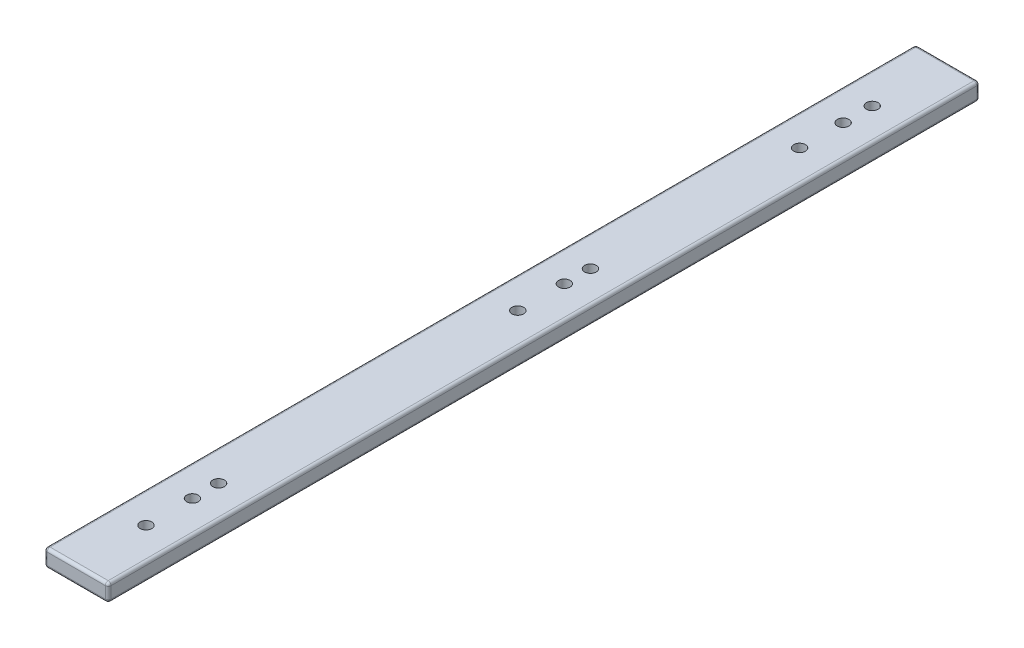
ISO-10303-21;
HEADER;
FILE_DESCRIPTION(('STEP AP214'),'2;1');
FILE_NAME('part.step','',(''),(''),'','','');
FILE_SCHEMA(('AUTOMOTIVE_DESIGN { 1 0 10303 214 1 1 1 1 }'));
ENDSEC;
DATA;
#1=APPLICATION_CONTEXT('core data for automotive mechanical design processes');
#2=APPLICATION_PROTOCOL_DEFINITION('international standard','automotive_design',2000,#1);
#3=PRODUCT_CONTEXT('',#1,'mechanical');
#4=PRODUCT('Part','Part','',(#3));
#5=PRODUCT_RELATED_PRODUCT_CATEGORY('part','',(#4));
#6=PRODUCT_DEFINITION_FORMATION('','',#4);
#7=PRODUCT_DEFINITION_CONTEXT('part definition',#1,'design');
#8=PRODUCT_DEFINITION('design','',#6,#7);
#9=PRODUCT_DEFINITION_SHAPE('','',#8);
#10=(LENGTH_UNIT() NAMED_UNIT(*) SI_UNIT(.MILLI.,.METRE.));
#11=(NAMED_UNIT(*) PLANE_ANGLE_UNIT() SI_UNIT($,.RADIAN.));
#12=(NAMED_UNIT(*) SI_UNIT($,.STERADIAN.) SOLID_ANGLE_UNIT());
#13=UNCERTAINTY_MEASURE_WITH_UNIT(LENGTH_MEASURE(1.E-05),#10,'distance_accuracy_value','');
#14=(GEOMETRIC_REPRESENTATION_CONTEXT(3) GLOBAL_UNCERTAINTY_ASSIGNED_CONTEXT((#13)) GLOBAL_UNIT_ASSIGNED_CONTEXT((#10,
#11,#12)) REPRESENTATION_CONTEXT('',''));
#15=CARTESIAN_POINT('',(0.,0.,0.));
#16=DIRECTION('',(0.,0.,1.));
#17=DIRECTION('',(1.,0.,0.));
#18=AXIS2_PLACEMENT_3D('',#15,#16,#17);
#19=CARTESIAN_POINT('',(11.,-3.,300.));
#20=DIRECTION('',(-1.,0.,0.));
#21=DIRECTION('',(0.,0.,1.));
#22=AXIS2_PLACEMENT_3D('',#19,#20,#21);
#23=PLANE('',#22);
#24=DIRECTION('',(0.,1.,0.));
#25=VECTOR('',#24,1.);
#26=CARTESIAN_POINT('',(11.,-3.,299.));
#27=LINE('',#26,#25);
#28=CARTESIAN_POINT('',(11.,2.,299.));
#29=VERTEX_POINT('',#28);
#30=CARTESIAN_POINT('',(11.,-2.,299.));
#31=VERTEX_POINT('',#30);
#32=EDGE_CURVE('E195',#29,#31,#27,.F.);
#33=ORIENTED_EDGE('',*,*,#32,.T.);
#34=DIRECTION('',(0.,0.,-1.));
#35=VECTOR('',#34,1.);
#36=CARTESIAN_POINT('',(11.,-2.,300.));
#37=LINE('',#36,#35);
#38=CARTESIAN_POINT('',(11.,-2.,1.));
#39=VERTEX_POINT('',#38);
#40=EDGE_CURVE('E198',#31,#39,#37,.T.);
#41=ORIENTED_EDGE('',*,*,#40,.T.);
#42=DIRECTION('',(0.,1.,0.));
#43=VECTOR('',#42,1.);
#44=CARTESIAN_POINT('',(11.,3.,1.));
#45=LINE('',#44,#43);
#46=CARTESIAN_POINT('',(11.,2.,1.));
#47=VERTEX_POINT('',#46);
#48=EDGE_CURVE('E193',#39,#47,#45,.T.);
#49=ORIENTED_EDGE('',*,*,#48,.T.);
#50=DIRECTION('',(0.,0.,-1.));
#51=VECTOR('',#50,1.);
#52=CARTESIAN_POINT('',(11.,2.,300.));
#53=LINE('',#52,#51);
#54=EDGE_CURVE('E191',#47,#29,#53,.F.);
#55=ORIENTED_EDGE('',*,*,#54,.T.);
#56=EDGE_LOOP('',(#33,#41,#49,#55));
#57=FACE_BOUND('',#56,.T.);
#58=ADVANCED_FACE('F38',(#57),#23,.F.);
#59=CARTESIAN_POINT('',(-11.,3.,300.));
#60=DIRECTION('',(0.,-1.,0.));
#61=DIRECTION('',(0.,0.,-1.));
#62=AXIS2_PLACEMENT_3D('',#59,#60,#61);
#63=PLANE('',#62);
#64=DIRECTION('',(-1.,0.,0.));
#65=VECTOR('',#64,1.);
#66=CARTESIAN_POINT('',(-11.,3.,1.));
#67=LINE('',#66,#65);
#68=CARTESIAN_POINT('',(10.,3.,1.));
#69=VERTEX_POINT('',#68);
#70=CARTESIAN_POINT('',(-10.,3.,1.));
#71=VERTEX_POINT('',#70);
#72=EDGE_CURVE('E184',#69,#71,#67,.T.);
#73=ORIENTED_EDGE('',*,*,#72,.T.);
#74=DIRECTION('',(0.,0.,-1.));
#75=VECTOR('',#74,1.);
#76=CARTESIAN_POINT('',(-10.,3.,300.));
#77=LINE('',#76,#75);
#78=CARTESIAN_POINT('',(-10.,3.,299.));
#79=VERTEX_POINT('',#78);
#80=EDGE_CURVE('E189',#71,#79,#77,.F.);
#81=ORIENTED_EDGE('',*,*,#80,.T.);
#82=DIRECTION('',(-1.,0.,0.));
#83=VECTOR('',#82,1.);
#84=CARTESIAN_POINT('',(-11.,3.,299.));
#85=LINE('',#84,#83);
#86=CARTESIAN_POINT('',(10.,3.,299.));
#87=VERTEX_POINT('',#86);
#88=EDGE_CURVE('E186',#79,#87,#85,.F.);
#89=ORIENTED_EDGE('',*,*,#88,.T.);
#90=DIRECTION('',(0.,0.,-1.));
#91=VECTOR('',#90,1.);
#92=CARTESIAN_POINT('',(10.,3.,300.));
#93=LINE('',#92,#91);
#94=EDGE_CURVE('E182',#87,#69,#93,.T.);
#95=ORIENTED_EDGE('',*,*,#94,.T.);
#96=EDGE_LOOP('',(#73,#81,#89,#95));
#97=FACE_BOUND('',#96,.T.);
#98=CARTESIAN_POINT('',(0.,3.,26.));
#99=DIRECTION('',(0.,1.,0.));
#100=DIRECTION('',(0.,0.,1.));
#101=AXIS2_PLACEMENT_3D('',#98,#99,#100);
#102=CIRCLE('',#101,2.);
#103=CARTESIAN_POINT('',(0.,3.,28.));
#104=VERTEX_POINT('',#103);
#105=EDGE_CURVE('E279',#104,#104,#102,.T.);
#106=ORIENTED_EDGE('',*,*,#105,.F.);
#107=EDGE_LOOP('',(#106));
#108=FACE_BOUND('',#107,.T.);
#109=CARTESIAN_POINT('',(0.,3.,132.));
#110=DIRECTION('',(0.,1.,0.));
#111=DIRECTION('',(0.,0.,1.));
#112=AXIS2_PLACEMENT_3D('',#109,#110,#111);
#113=CIRCLE('',#112,2.);
#114=CARTESIAN_POINT('',(0.,3.,134.));
#115=VERTEX_POINT('',#114);
#116=EDGE_CURVE('E261',#115,#115,#113,.T.);
#117=ORIENTED_EDGE('',*,*,#116,.F.);
#118=EDGE_LOOP('',(#117));
#119=FACE_BOUND('',#118,.T.);
#120=CARTESIAN_POINT('',(0.,3.,123.));
#121=DIRECTION('',(0.,1.,0.));
#122=DIRECTION('',(0.,0.,1.));
#123=AXIS2_PLACEMENT_3D('',#120,#121,#122);
#124=CIRCLE('',#123,2.);
#125=CARTESIAN_POINT('',(0.,3.,125.));
#126=VERTEX_POINT('',#125);
#127=EDGE_CURVE('E272',#126,#126,#124,.T.);
#128=ORIENTED_EDGE('',*,*,#127,.F.);
#129=EDGE_LOOP('',(#128));
#130=FACE_BOUND('',#129,.T.);
#131=CARTESIAN_POINT('',(0.,3.,148.));
#132=DIRECTION('',(0.,1.,0.));
#133=DIRECTION('',(0.,0.,1.));
#134=AXIS2_PLACEMENT_3D('',#131,#132,#133);
#135=CIRCLE('',#134,2.);
#136=CARTESIAN_POINT('',(0.,3.,150.));
#137=VERTEX_POINT('',#136);
#138=EDGE_CURVE('E676',#137,#137,#135,.T.);
#139=ORIENTED_EDGE('',*,*,#138,.F.);
#140=EDGE_LOOP('',(#139));
#141=FACE_BOUND('',#140,.T.);
#142=CARTESIAN_POINT('',(0.,3.,251.));
#143=DIRECTION('',(0.,1.,0.));
#144=DIRECTION('',(0.,0.,1.));
#145=AXIS2_PLACEMENT_3D('',#142,#143,#144);
#146=CIRCLE('',#145,2.);
#147=CARTESIAN_POINT('',(0.,3.,253.));
#148=VERTEX_POINT('',#147);
#149=EDGE_CURVE('E680',#148,#148,#146,.T.);
#150=ORIENTED_EDGE('',*,*,#149,.F.);
#151=EDGE_LOOP('',(#150));
#152=FACE_BOUND('',#151,.T.);
#153=CARTESIAN_POINT('',(0.,3.,276.));
#154=DIRECTION('',(0.,1.,0.));
#155=DIRECTION('',(0.,0.,1.));
#156=AXIS2_PLACEMENT_3D('',#153,#154,#155);
#157=CIRCLE('',#156,2.);
#158=CARTESIAN_POINT('',(0.,3.,278.));
#159=VERTEX_POINT('',#158);
#160=EDGE_CURVE('E298',#159,#159,#157,.T.);
#161=ORIENTED_EDGE('',*,*,#160,.F.);
#162=EDGE_LOOP('',(#161));
#163=FACE_BOUND('',#162,.T.);
#164=CARTESIAN_POINT('',(0.,3.,260.));
#165=DIRECTION('',(0.,1.,0.));
#166=DIRECTION('',(0.,0.,1.));
#167=AXIS2_PLACEMENT_3D('',#164,#165,#166);
#168=CIRCLE('',#167,2.);
#169=CARTESIAN_POINT('',(0.,3.,262.));
#170=VERTEX_POINT('',#169);
#171=EDGE_CURVE('E292',#170,#170,#168,.T.);
#172=ORIENTED_EDGE('',*,*,#171,.F.);
#173=EDGE_LOOP('',(#172));
#174=FACE_BOUND('',#173,.T.);
#175=CARTESIAN_POINT('',(0.,3.,51.));
#176=DIRECTION('',(0.,1.,0.));
#177=DIRECTION('',(0.,0.,1.));
#178=AXIS2_PLACEMENT_3D('',#175,#176,#177);
#179=CIRCLE('',#178,2.);
#180=CARTESIAN_POINT('',(0.,3.,53.));
#181=VERTEX_POINT('',#180);
#182=EDGE_CURVE('E286',#181,#181,#179,.T.);
#183=ORIENTED_EDGE('',*,*,#182,.F.);
#184=EDGE_LOOP('',(#183));
#185=FACE_BOUND('',#184,.T.);
#186=CARTESIAN_POINT('',(0.,3.,36.));
#187=DIRECTION('',(0.,1.,0.));
#188=DIRECTION('',(0.,0.,1.));
#189=AXIS2_PLACEMENT_3D('',#186,#187,#188);
#190=CIRCLE('',#189,2.);
#191=CARTESIAN_POINT('',(0.,3.,38.));
#192=VERTEX_POINT('',#191);
#193=EDGE_CURVE('E280',#192,#192,#190,.T.);
#194=ORIENTED_EDGE('',*,*,#193,.F.);
#195=EDGE_LOOP('',(#194));
#196=FACE_BOUND('',#195,.T.);
#197=ADVANCED_FACE('F353',(#97,#108,#119,#130,#141,#152,#163,#174,#185,#196),#63,.F.);
#198=CARTESIAN_POINT('',(-11.,-3.,300.));
#199=DIRECTION('',(1.,0.,0.));
#200=DIRECTION('',(0.,0.,-1.));
#201=AXIS2_PLACEMENT_3D('',#198,#199,#200);
#202=PLANE('',#201);
#203=DIRECTION('',(0.,-1.,0.));
#204=VECTOR('',#203,1.);
#205=CARTESIAN_POINT('',(-11.,-3.,299.));
#206=LINE('',#205,#204);
#207=CARTESIAN_POINT('',(-11.,-2.,299.));
#208=VERTEX_POINT('',#207);
#209=CARTESIAN_POINT('',(-11.,2.,299.));
#210=VERTEX_POINT('',#209);
#211=EDGE_CURVE('E177',#208,#210,#206,.F.);
#212=ORIENTED_EDGE('',*,*,#211,.T.);
#213=DIRECTION('',(0.,0.,-1.));
#214=VECTOR('',#213,1.);
#215=CARTESIAN_POINT('',(-11.,2.,300.));
#216=LINE('',#215,#214);
#217=CARTESIAN_POINT('',(-11.,2.,1.));
#218=VERTEX_POINT('',#217);
#219=EDGE_CURVE('E180',#210,#218,#216,.T.);
#220=ORIENTED_EDGE('',*,*,#219,.T.);
#221=DIRECTION('',(0.,-1.,0.));
#222=VECTOR('',#221,1.);
#223=CARTESIAN_POINT('',(-11.,-3.,1.));
#224=LINE('',#223,#222);
#225=CARTESIAN_POINT('',(-11.,-2.,1.));
#226=VERTEX_POINT('',#225);
#227=EDGE_CURVE('E175',#218,#226,#224,.T.);
#228=ORIENTED_EDGE('',*,*,#227,.T.);
#229=DIRECTION('',(0.,0.,-1.));
#230=VECTOR('',#229,1.);
#231=CARTESIAN_POINT('',(-11.,-2.,300.));
#232=LINE('',#231,#230);
#233=EDGE_CURVE('E173',#226,#208,#232,.F.);
#234=ORIENTED_EDGE('',*,*,#233,.T.);
#235=EDGE_LOOP('',(#212,#220,#228,#234));
#236=FACE_BOUND('',#235,.T.);
#237=ADVANCED_FACE('F358',(#236),#202,.F.);
#238=CARTESIAN_POINT('',(-11.,-3.,300.));
#239=DIRECTION('',(0.,1.,0.));
#240=DIRECTION('',(0.,0.,1.));
#241=AXIS2_PLACEMENT_3D('',#238,#239,#240);
#242=PLANE('',#241);
#243=DIRECTION('',(1.,0.,0.));
#244=VECTOR('',#243,1.);
#245=CARTESIAN_POINT('',(-11.,-3.,299.));
#246=LINE('',#245,#244);
#247=CARTESIAN_POINT('',(10.,-3.,299.));
#248=VERTEX_POINT('',#247);
#249=CARTESIAN_POINT('',(-10.,-3.,299.));
#250=VERTEX_POINT('',#249);
#251=EDGE_CURVE('E133',#248,#250,#246,.F.);
#252=ORIENTED_EDGE('',*,*,#251,.T.);
#253=DIRECTION('',(0.,0.,-1.));
#254=VECTOR('',#253,1.);
#255=CARTESIAN_POINT('',(-10.,-3.,300.));
#256=LINE('',#255,#254);
#257=CARTESIAN_POINT('',(-10.,-3.,1.));
#258=VERTEX_POINT('',#257);
#259=EDGE_CURVE('E171',#250,#258,#256,.T.);
#260=ORIENTED_EDGE('',*,*,#259,.T.);
#261=DIRECTION('',(1.,0.,0.));
#262=VECTOR('',#261,1.);
#263=CARTESIAN_POINT('',(11.,-3.,1.));
#264=LINE('',#263,#262);
#265=CARTESIAN_POINT('',(10.,-3.,1.));
#266=VERTEX_POINT('',#265);
#267=EDGE_CURVE('E164',#258,#266,#264,.T.);
#268=ORIENTED_EDGE('',*,*,#267,.T.);
#269=DIRECTION('',(0.,0.,-1.));
#270=VECTOR('',#269,1.);
#271=CARTESIAN_POINT('',(10.,-3.,300.));
#272=LINE('',#271,#270);
#273=EDGE_CURVE('E162',#266,#248,#272,.F.);
#274=ORIENTED_EDGE('',*,*,#273,.T.);
#275=EDGE_LOOP('',(#252,#260,#268,#274));
#276=FACE_BOUND('',#275,.T.);
#277=CARTESIAN_POINT('',(0.,-3.,26.));
#278=DIRECTION('',(0.,1.,0.));
#279=DIRECTION('',(0.,0.,1.));
#280=AXIS2_PLACEMENT_3D('',#277,#278,#279);
#281=CIRCLE('',#280,2.);
#282=CARTESIAN_POINT('',(0.,-3.,28.));
#283=VERTEX_POINT('',#282);
#284=EDGE_CURVE('E156',#283,#283,#281,.T.);
#285=ORIENTED_EDGE('',*,*,#284,.T.);
#286=EDGE_LOOP('',(#285));
#287=FACE_BOUND('',#286,.T.);
#288=CARTESIAN_POINT('',(0.,-3.,132.));
#289=DIRECTION('',(0.,1.,0.));
#290=DIRECTION('',(0.,0.,1.));
#291=AXIS2_PLACEMENT_3D('',#288,#289,#290);
#292=CIRCLE('',#291,2.);
#293=CARTESIAN_POINT('',(0.,-3.,134.));
#294=VERTEX_POINT('',#293);
#295=EDGE_CURVE('E267',#294,#294,#292,.T.);
#296=ORIENTED_EDGE('',*,*,#295,.T.);
#297=EDGE_LOOP('',(#296));
#298=FACE_BOUND('',#297,.T.);
#299=CARTESIAN_POINT('',(0.,-3.,123.));
#300=DIRECTION('',(0.,1.,0.));
#301=DIRECTION('',(0.,0.,1.));
#302=AXIS2_PLACEMENT_3D('',#299,#300,#301);
#303=CIRCLE('',#302,2.);
#304=CARTESIAN_POINT('',(0.,-3.,125.));
#305=VERTEX_POINT('',#304);
#306=EDGE_CURVE('E702',#305,#305,#303,.T.);
#307=ORIENTED_EDGE('',*,*,#306,.T.);
#308=EDGE_LOOP('',(#307));
#309=FACE_BOUND('',#308,.T.);
#310=CARTESIAN_POINT('',(0.,-3.,148.));
#311=DIRECTION('',(0.,1.,0.));
#312=DIRECTION('',(0.,0.,1.));
#313=AXIS2_PLACEMENT_3D('',#310,#311,#312);
#314=CIRCLE('',#313,2.);
#315=CARTESIAN_POINT('',(0.,-3.,150.));
#316=VERTEX_POINT('',#315);
#317=EDGE_CURVE('E693',#316,#316,#314,.T.);
#318=ORIENTED_EDGE('',*,*,#317,.T.);
#319=EDGE_LOOP('',(#318));
#320=FACE_BOUND('',#319,.T.);
#321=CARTESIAN_POINT('',(0.,-3.,251.));
#322=DIRECTION('',(0.,1.,0.));
#323=DIRECTION('',(0.,0.,1.));
#324=AXIS2_PLACEMENT_3D('',#321,#322,#323);
#325=CIRCLE('',#324,2.);
#326=CARTESIAN_POINT('',(0.,-3.,253.));
#327=VERTEX_POINT('',#326);
#328=EDGE_CURVE('E300',#327,#327,#325,.T.);
#329=ORIENTED_EDGE('',*,*,#328,.T.);
#330=EDGE_LOOP('',(#329));
#331=FACE_BOUND('',#330,.T.);
#332=CARTESIAN_POINT('',(0.,-3.,276.));
#333=DIRECTION('',(0.,1.,0.));
#334=DIRECTION('',(0.,0.,1.));
#335=AXIS2_PLACEMENT_3D('',#332,#333,#334);
#336=CIRCLE('',#335,2.);
#337=CARTESIAN_POINT('',(0.,-3.,278.));
#338=VERTEX_POINT('',#337);
#339=EDGE_CURVE('E295',#338,#338,#336,.T.);
#340=ORIENTED_EDGE('',*,*,#339,.T.);
#341=EDGE_LOOP('',(#340));
#342=FACE_BOUND('',#341,.T.);
#343=CARTESIAN_POINT('',(0.,-3.,260.));
#344=DIRECTION('',(0.,1.,0.));
#345=DIRECTION('',(0.,0.,1.));
#346=AXIS2_PLACEMENT_3D('',#343,#344,#345);
#347=CIRCLE('',#346,2.);
#348=CARTESIAN_POINT('',(0.,-3.,262.));
#349=VERTEX_POINT('',#348);
#350=EDGE_CURVE('E289',#349,#349,#347,.T.);
#351=ORIENTED_EDGE('',*,*,#350,.T.);
#352=EDGE_LOOP('',(#351));
#353=FACE_BOUND('',#352,.T.);
#354=CARTESIAN_POINT('',(0.,-3.,51.));
#355=DIRECTION('',(0.,1.,0.));
#356=DIRECTION('',(0.,0.,1.));
#357=AXIS2_PLACEMENT_3D('',#354,#355,#356);
#358=CIRCLE('',#357,2.);
#359=CARTESIAN_POINT('',(0.,-3.,53.));
#360=VERTEX_POINT('',#359);
#361=EDGE_CURVE('E283',#360,#360,#358,.T.);
#362=ORIENTED_EDGE('',*,*,#361,.T.);
#363=EDGE_LOOP('',(#362));
#364=FACE_BOUND('',#363,.T.);
#365=CARTESIAN_POINT('',(0.,-3.,36.));
#366=DIRECTION('',(0.,1.,0.));
#367=DIRECTION('',(0.,0.,1.));
#368=AXIS2_PLACEMENT_3D('',#365,#366,#367);
#369=CIRCLE('',#368,2.);
#370=CARTESIAN_POINT('',(0.,-3.,38.));
#371=VERTEX_POINT('',#370);
#372=EDGE_CURVE('E276',#371,#371,#369,.T.);
#373=ORIENTED_EDGE('',*,*,#372,.T.);
#374=EDGE_LOOP('',(#373));
#375=FACE_BOUND('',#374,.T.);
#376=ADVANCED_FACE('F325',(#276,#287,#298,#309,#320,#331,#342,#353,#364,#375),#242,.F.);
#377=CARTESIAN_POINT('',(0.,0.,300.));
#378=DIRECTION('',(0.,0.,-1.));
#379=DIRECTION('',(-1.,0.,0.));
#380=AXIS2_PLACEMENT_3D('',#377,#378,#379);
#381=PLANE('',#380);
#382=DIRECTION('',(0.,-1.,0.));
#383=VECTOR('',#382,1.);
#384=CARTESIAN_POINT('',(-10.,0.,300.));
#385=LINE('',#384,#383);
#386=CARTESIAN_POINT('',(-10.,2.,300.));
#387=VERTEX_POINT('',#386);
#388=CARTESIAN_POINT('',(-10.,-2.,300.));
#389=VERTEX_POINT('',#388);
#390=EDGE_CURVE('E160',#387,#389,#385,.T.);
#391=ORIENTED_EDGE('',*,*,#390,.T.);
#392=DIRECTION('',(1.,0.,0.));
#393=VECTOR('',#392,1.);
#394=CARTESIAN_POINT('',(0.,-2.,300.));
#395=LINE('',#394,#393);
#396=CARTESIAN_POINT('',(10.,-2.,300.));
#397=VERTEX_POINT('',#396);
#398=EDGE_CURVE('E131',#389,#397,#395,.T.);
#399=ORIENTED_EDGE('',*,*,#398,.T.);
#400=DIRECTION('',(0.,1.,0.));
#401=VECTOR('',#400,1.);
#402=CARTESIAN_POINT('',(10.,0.,300.));
#403=LINE('',#402,#401);
#404=CARTESIAN_POINT('',(10.,2.,300.));
#405=VERTEX_POINT('',#404);
#406=EDGE_CURVE('E149',#397,#405,#403,.T.);
#407=ORIENTED_EDGE('',*,*,#406,.T.);
#408=DIRECTION('',(-1.,0.,0.));
#409=VECTOR('',#408,1.);
#410=CARTESIAN_POINT('',(0.,2.,300.));
#411=LINE('',#410,#409);
#412=EDGE_CURVE('E155',#405,#387,#411,.T.);
#413=ORIENTED_EDGE('',*,*,#412,.T.);
#414=EDGE_LOOP('',(#391,#399,#407,#413));
#415=FACE_BOUND('',#414,.T.);
#416=ADVANCED_FACE('F158',(#415),#381,.F.);
#417=CARTESIAN_POINT('',(0.,0.,0.));
#418=DIRECTION('',(0.,0.,-1.));
#419=DIRECTION('',(-1.,0.,0.));
#420=AXIS2_PLACEMENT_3D('',#417,#418,#419);
#421=PLANE('',#420);
#422=DIRECTION('',(0.,-1.,0.));
#423=VECTOR('',#422,1.);
#424=CARTESIAN_POINT('',(-10.,3.,0.));
#425=LINE('',#424,#423);
#426=CARTESIAN_POINT('',(-10.,-2.,0.));
#427=VERTEX_POINT('',#426);
#428=CARTESIAN_POINT('',(-10.,2.,0.));
#429=VERTEX_POINT('',#428);
#430=EDGE_CURVE('E47',#427,#429,#425,.F.);
#431=ORIENTED_EDGE('',*,*,#430,.T.);
#432=DIRECTION('',(-1.,0.,0.));
#433=VECTOR('',#432,1.);
#434=CARTESIAN_POINT('',(11.,2.,0.));
#435=LINE('',#434,#433);
#436=CARTESIAN_POINT('',(10.,2.,0.));
#437=VERTEX_POINT('',#436);
#438=EDGE_CURVE('E11',#429,#437,#435,.F.);
#439=ORIENTED_EDGE('',*,*,#438,.T.);
#440=DIRECTION('',(0.,1.,0.));
#441=VECTOR('',#440,1.);
#442=CARTESIAN_POINT('',(10.,-3.,0.));
#443=LINE('',#442,#441);
#444=CARTESIAN_POINT('',(10.,-2.,0.));
#445=VERTEX_POINT('',#444);
#446=EDGE_CURVE('E200',#437,#445,#443,.F.);
#447=ORIENTED_EDGE('',*,*,#446,.T.);
#448=DIRECTION('',(1.,0.,0.));
#449=VECTOR('',#448,1.);
#450=CARTESIAN_POINT('',(-11.,-2.,0.));
#451=LINE('',#450,#449);
#452=EDGE_CURVE('E58',#445,#427,#451,.F.);
#453=ORIENTED_EDGE('',*,*,#452,.T.);
#454=EDGE_LOOP('',(#431,#439,#447,#453));
#455=FACE_BOUND('',#454,.T.);
#456=ADVANCED_FACE('F593',(#455),#421,.T.);
#457=CARTESIAN_POINT('',(0.,-3.,36.));
#458=DIRECTION('',(0.,1.,0.));
#459=DIRECTION('',(0.,0.,1.));
#460=AXIS2_PLACEMENT_3D('',#457,#458,#459);
#461=CYLINDRICAL_SURFACE('',#460,2.);
#462=ORIENTED_EDGE('',*,*,#372,.F.);
#463=EDGE_LOOP('',(#462));
#464=FACE_BOUND('',#463,.T.);
#465=ORIENTED_EDGE('',*,*,#193,.T.);
#466=EDGE_LOOP('',(#465));
#467=FACE_BOUND('',#466,.T.);
#468=ADVANCED_FACE('F584',(#464,#467),#461,.F.);
#469=CARTESIAN_POINT('',(0.,-3.,51.));
#470=DIRECTION('',(0.,1.,0.));
#471=DIRECTION('',(0.,0.,1.));
#472=AXIS2_PLACEMENT_3D('',#469,#470,#471);
#473=CYLINDRICAL_SURFACE('',#472,2.);
#474=ORIENTED_EDGE('',*,*,#361,.F.);
#475=EDGE_LOOP('',(#474));
#476=FACE_BOUND('',#475,.T.);
#477=ORIENTED_EDGE('',*,*,#182,.T.);
#478=EDGE_LOOP('',(#477));
#479=FACE_BOUND('',#478,.T.);
#480=ADVANCED_FACE('F575',(#476,#479),#473,.F.);
#481=CARTESIAN_POINT('',(0.,-3.,260.));
#482=DIRECTION('',(0.,1.,0.));
#483=DIRECTION('',(0.,0.,1.));
#484=AXIS2_PLACEMENT_3D('',#481,#482,#483);
#485=CYLINDRICAL_SURFACE('',#484,2.);
#486=ORIENTED_EDGE('',*,*,#350,.F.);
#487=EDGE_LOOP('',(#486));
#488=FACE_BOUND('',#487,.T.);
#489=ORIENTED_EDGE('',*,*,#171,.T.);
#490=EDGE_LOOP('',(#489));
#491=FACE_BOUND('',#490,.T.);
#492=ADVANCED_FACE('F566',(#488,#491),#485,.F.);
#493=CARTESIAN_POINT('',(0.,-3.,276.));
#494=DIRECTION('',(0.,1.,0.));
#495=DIRECTION('',(0.,0.,1.));
#496=AXIS2_PLACEMENT_3D('',#493,#494,#495);
#497=CYLINDRICAL_SURFACE('',#496,2.);
#498=ORIENTED_EDGE('',*,*,#339,.F.);
#499=EDGE_LOOP('',(#498));
#500=FACE_BOUND('',#499,.T.);
#501=ORIENTED_EDGE('',*,*,#160,.T.);
#502=EDGE_LOOP('',(#501));
#503=FACE_BOUND('',#502,.T.);
#504=ADVANCED_FACE('F557',(#500,#503),#497,.F.);
#505=CARTESIAN_POINT('',(0.,-3.,251.));
#506=DIRECTION('',(0.,1.,0.));
#507=DIRECTION('',(0.,0.,1.));
#508=AXIS2_PLACEMENT_3D('',#505,#506,#507);
#509=CYLINDRICAL_SURFACE('',#508,2.);
#510=ORIENTED_EDGE('',*,*,#328,.F.);
#511=EDGE_LOOP('',(#510));
#512=FACE_BOUND('',#511,.T.);
#513=ORIENTED_EDGE('',*,*,#149,.T.);
#514=EDGE_LOOP('',(#513));
#515=FACE_BOUND('',#514,.T.);
#516=ADVANCED_FACE('F548',(#512,#515),#509,.F.);
#517=CARTESIAN_POINT('',(0.,-3.,148.));
#518=DIRECTION('',(0.,1.,0.));
#519=DIRECTION('',(0.,0.,1.));
#520=AXIS2_PLACEMENT_3D('',#517,#518,#519);
#521=CYLINDRICAL_SURFACE('',#520,2.);
#522=ORIENTED_EDGE('',*,*,#317,.F.);
#523=EDGE_LOOP('',(#522));
#524=FACE_BOUND('',#523,.T.);
#525=ORIENTED_EDGE('',*,*,#138,.T.);
#526=EDGE_LOOP('',(#525));
#527=FACE_BOUND('',#526,.T.);
#528=ADVANCED_FACE('F539',(#524,#527),#521,.F.);
#529=CARTESIAN_POINT('',(0.,-3.,123.));
#530=DIRECTION('',(0.,1.,0.));
#531=DIRECTION('',(0.,0.,1.));
#532=AXIS2_PLACEMENT_3D('',#529,#530,#531);
#533=CYLINDRICAL_SURFACE('',#532,2.);
#534=ORIENTED_EDGE('',*,*,#306,.F.);
#535=EDGE_LOOP('',(#534));
#536=FACE_BOUND('',#535,.T.);
#537=ORIENTED_EDGE('',*,*,#127,.T.);
#538=EDGE_LOOP('',(#537));
#539=FACE_BOUND('',#538,.T.);
#540=ADVANCED_FACE('F530',(#536,#539),#533,.F.);
#541=CARTESIAN_POINT('',(0.,-3.,132.));
#542=DIRECTION('',(0.,1.,0.));
#543=DIRECTION('',(0.,0.,1.));
#544=AXIS2_PLACEMENT_3D('',#541,#542,#543);
#545=CYLINDRICAL_SURFACE('',#544,2.);
#546=ORIENTED_EDGE('',*,*,#295,.F.);
#547=EDGE_LOOP('',(#546));
#548=FACE_BOUND('',#547,.T.);
#549=ORIENTED_EDGE('',*,*,#116,.T.);
#550=EDGE_LOOP('',(#549));
#551=FACE_BOUND('',#550,.T.);
#552=ADVANCED_FACE('F521',(#548,#551),#545,.F.);
#553=CARTESIAN_POINT('',(0.,-3.,26.));
#554=DIRECTION('',(0.,1.,0.));
#555=DIRECTION('',(0.,0.,1.));
#556=AXIS2_PLACEMENT_3D('',#553,#554,#555);
#557=CYLINDRICAL_SURFACE('',#556,2.);
#558=ORIENTED_EDGE('',*,*,#284,.F.);
#559=EDGE_LOOP('',(#558));
#560=FACE_BOUND('',#559,.T.);
#561=ORIENTED_EDGE('',*,*,#105,.T.);
#562=EDGE_LOOP('',(#561));
#563=FACE_BOUND('',#562,.T.);
#564=ADVANCED_FACE('F512',(#560,#563),#557,.F.);
#565=CARTESIAN_POINT('',(-11.,2.,1.));
#566=DIRECTION('',(1.,0.,0.));
#567=DIRECTION('',(0.,0.,-1.));
#568=AXIS2_PLACEMENT_3D('',#565,#566,#567);
#569=CYLINDRICAL_SURFACE('',#568,1.);
#570=CARTESIAN_POINT('',(-10.,2.,1.));
#571=DIRECTION('',(-1.,0.,0.));
#572=DIRECTION('',(0.,0.,1.));
#573=AXIS2_PLACEMENT_3D('',#570,#571,#572);
#574=CIRCLE('',#573,1.);
#575=EDGE_CURVE('E42',#71,#429,#574,.T.);
#576=ORIENTED_EDGE('',*,*,#575,.F.);
#577=ORIENTED_EDGE('',*,*,#72,.F.);
#578=CARTESIAN_POINT('',(10.,2.,1.));
#579=DIRECTION('',(1.,0.,0.));
#580=DIRECTION('',(0.,1.,0.));
#581=AXIS2_PLACEMENT_3D('',#578,#579,#580);
#582=CIRCLE('',#581,1.);
#583=EDGE_CURVE('E254',#437,#69,#582,.T.);
#584=ORIENTED_EDGE('',*,*,#583,.F.);
#585=ORIENTED_EDGE('',*,*,#438,.F.);
#586=EDGE_LOOP('',(#576,#577,#584,#585));
#587=FACE_BOUND('',#586,.T.);
#588=ADVANCED_FACE('F40',(#587),#569,.T.);
#589=CARTESIAN_POINT('',(-10.,2.,1.));
#590=DIRECTION('',(0.,0.,1.));
#591=DIRECTION('',(1.,0.,0.));
#592=AXIS2_PLACEMENT_3D('',#589,#590,#591);
#593=SPHERICAL_SURFACE('',#592,1.);
#594=CARTESIAN_POINT('',(-10.,2.,1.));
#595=DIRECTION('',(0.,0.,-1.));
#596=DIRECTION('',(-1.,0.,0.));
#597=AXIS2_PLACEMENT_3D('',#594,#595,#596);
#598=CIRCLE('',#597,1.);
#599=EDGE_CURVE('E249',#71,#218,#598,.F.);
#600=ORIENTED_EDGE('',*,*,#599,.F.);
#601=ORIENTED_EDGE('',*,*,#575,.T.);
#602=CARTESIAN_POINT('',(-10.,2.,1.));
#603=DIRECTION('',(0.,1.,0.));
#604=DIRECTION('',(0.,0.,1.));
#605=AXIS2_PLACEMENT_3D('',#602,#603,#604);
#606=CIRCLE('',#605,1.);
#607=EDGE_CURVE('E252',#218,#429,#606,.F.);
#608=ORIENTED_EDGE('',*,*,#607,.F.);
#609=EDGE_LOOP('',(#600,#601,#608));
#610=FACE_BOUND('',#609,.T.);
#611=ADVANCED_FACE('F498',(#610),#593,.T.);
#612=CARTESIAN_POINT('',(10.,2.,1.));
#613=DIRECTION('',(0.,0.,1.));
#614=DIRECTION('',(1.,0.,0.));
#615=AXIS2_PLACEMENT_3D('',#612,#613,#614);
#616=SPHERICAL_SURFACE('',#615,1.);
#617=CARTESIAN_POINT('',(10.,2.,1.));
#618=DIRECTION('',(0.,1.,0.));
#619=DIRECTION('',(0.,0.,1.));
#620=AXIS2_PLACEMENT_3D('',#617,#618,#619);
#621=CIRCLE('',#620,1.);
#622=EDGE_CURVE('E243',#437,#47,#621,.F.);
#623=ORIENTED_EDGE('',*,*,#622,.F.);
#624=ORIENTED_EDGE('',*,*,#583,.T.);
#625=CARTESIAN_POINT('',(10.,2.,1.));
#626=DIRECTION('',(0.,0.,-1.));
#627=DIRECTION('',(-1.,0.,0.));
#628=AXIS2_PLACEMENT_3D('',#625,#626,#627);
#629=CIRCLE('',#628,1.);
#630=EDGE_CURVE('E246',#47,#69,#629,.F.);
#631=ORIENTED_EDGE('',*,*,#630,.F.);
#632=EDGE_LOOP('',(#623,#624,#631));
#633=FACE_BOUND('',#632,.T.);
#634=ADVANCED_FACE('F489',(#633),#616,.T.);
#635=CARTESIAN_POINT('',(-10.,-3.,1.));
#636=DIRECTION('',(0.,1.,0.));
#637=DIRECTION('',(0.,0.,1.));
#638=AXIS2_PLACEMENT_3D('',#635,#636,#637);
#639=CYLINDRICAL_SURFACE('',#638,1.);
#640=ORIENTED_EDGE('',*,*,#607,.T.);
#641=ORIENTED_EDGE('',*,*,#430,.F.);
#642=CARTESIAN_POINT('',(-10.,-2.,1.));
#643=DIRECTION('',(0.,-1.,0.));
#644=DIRECTION('',(0.,0.,-1.));
#645=AXIS2_PLACEMENT_3D('',#642,#643,#644);
#646=CIRCLE('',#645,1.);
#647=EDGE_CURVE('E237',#226,#427,#646,.T.);
#648=ORIENTED_EDGE('',*,*,#647,.F.);
#649=ORIENTED_EDGE('',*,*,#227,.F.);
#650=EDGE_LOOP('',(#640,#641,#648,#649));
#651=FACE_BOUND('',#650,.T.);
#652=ADVANCED_FACE('F480',(#651),#639,.T.);
#653=CARTESIAN_POINT('',(-10.,2.,300.));
#654=DIRECTION('',(0.,0.,-1.));
#655=DIRECTION('',(-1.,0.,0.));
#656=AXIS2_PLACEMENT_3D('',#653,#654,#655);
#657=CYLINDRICAL_SURFACE('',#656,1.);
#658=ORIENTED_EDGE('',*,*,#599,.T.);
#659=ORIENTED_EDGE('',*,*,#219,.F.);
#660=CARTESIAN_POINT('',(-10.,2.,299.));
#661=DIRECTION('',(0.,0.,1.));
#662=DIRECTION('',(1.,0.,0.));
#663=AXIS2_PLACEMENT_3D('',#660,#661,#662);
#664=CIRCLE('',#663,1.);
#665=EDGE_CURVE('E234',#79,#210,#664,.T.);
#666=ORIENTED_EDGE('',*,*,#665,.F.);
#667=ORIENTED_EDGE('',*,*,#80,.F.);
#668=EDGE_LOOP('',(#658,#659,#666,#667));
#669=FACE_BOUND('',#668,.T.);
#670=ADVANCED_FACE('F472',(#669),#657,.T.);
#671=CARTESIAN_POINT('',(0.,2.,299.));
#672=DIRECTION('',(-1.,0.,0.));
#673=DIRECTION('',(0.,0.,1.));
#674=AXIS2_PLACEMENT_3D('',#671,#672,#673);
#675=CYLINDRICAL_SURFACE('',#674,1.);
#676=CARTESIAN_POINT('',(10.,2.,299.));
#677=DIRECTION('',(1.,0.,0.));
#678=DIRECTION('',(0.,0.,-1.));
#679=AXIS2_PLACEMENT_3D('',#676,#677,#678);
#680=CIRCLE('',#679,1.);
#681=EDGE_CURVE('E228',#87,#405,#680,.T.);
#682=ORIENTED_EDGE('',*,*,#681,.F.);
#683=ORIENTED_EDGE('',*,*,#88,.F.);
#684=CARTESIAN_POINT('',(-10.,2.,299.));
#685=DIRECTION('',(-1.,0.,0.));
#686=DIRECTION('',(0.,0.,1.));
#687=AXIS2_PLACEMENT_3D('',#684,#685,#686);
#688=CIRCLE('',#687,1.);
#689=EDGE_CURVE('E231',#387,#79,#688,.T.);
#690=ORIENTED_EDGE('',*,*,#689,.F.);
#691=ORIENTED_EDGE('',*,*,#412,.F.);
#692=EDGE_LOOP('',(#682,#683,#690,#691));
#693=FACE_BOUND('',#692,.T.);
#694=ADVANCED_FACE('F306',(#693),#675,.T.);
#695=CARTESIAN_POINT('',(10.,2.,300.));
#696=DIRECTION('',(0.,0.,-1.));
#697=DIRECTION('',(-1.,0.,0.));
#698=AXIS2_PLACEMENT_3D('',#695,#696,#697);
#699=CYLINDRICAL_SURFACE('',#698,1.);
#700=ORIENTED_EDGE('',*,*,#630,.T.);
#701=ORIENTED_EDGE('',*,*,#94,.F.);
#702=CARTESIAN_POINT('',(10.,2.,299.));
#703=DIRECTION('',(0.,0.,1.));
#704=DIRECTION('',(1.,0.,0.));
#705=AXIS2_PLACEMENT_3D('',#702,#703,#704);
#706=CIRCLE('',#705,1.);
#707=EDGE_CURVE('E226',#29,#87,#706,.T.);
#708=ORIENTED_EDGE('',*,*,#707,.F.);
#709=ORIENTED_EDGE('',*,*,#54,.F.);
#710=EDGE_LOOP('',(#700,#701,#708,#709));
#711=FACE_BOUND('',#710,.T.);
#712=ADVANCED_FACE('F338',(#711),#699,.T.);
#713=CARTESIAN_POINT('',(10.,-3.,1.));
#714=DIRECTION('',(0.,-1.,0.));
#715=DIRECTION('',(0.,0.,-1.));
#716=AXIS2_PLACEMENT_3D('',#713,#714,#715);
#717=CYLINDRICAL_SURFACE('',#716,1.);
#718=ORIENTED_EDGE('',*,*,#622,.T.);
#719=ORIENTED_EDGE('',*,*,#48,.F.);
#720=CARTESIAN_POINT('',(10.,-2.,1.));
#721=DIRECTION('',(0.,-1.,0.));
#722=DIRECTION('',(0.,0.,-1.));
#723=AXIS2_PLACEMENT_3D('',#720,#721,#722);
#724=CIRCLE('',#723,1.);
#725=EDGE_CURVE('E223',#445,#39,#724,.T.);
#726=ORIENTED_EDGE('',*,*,#725,.F.);
#727=ORIENTED_EDGE('',*,*,#446,.F.);
#728=EDGE_LOOP('',(#718,#719,#726,#727));
#729=FACE_BOUND('',#728,.T.);
#730=ADVANCED_FACE('F448',(#729),#717,.T.);
#731=CARTESIAN_POINT('',(-11.,-2.,1.));
#732=DIRECTION('',(-1.,0.,0.));
#733=DIRECTION('',(0.,0.,1.));
#734=AXIS2_PLACEMENT_3D('',#731,#732,#733);
#735=CYLINDRICAL_SURFACE('',#734,1.);
#736=CARTESIAN_POINT('',(-10.,-2.,1.));
#737=DIRECTION('',(-1.,0.,0.));
#738=DIRECTION('',(0.,0.,1.));
#739=AXIS2_PLACEMENT_3D('',#736,#737,#738);
#740=CIRCLE('',#739,1.);
#741=EDGE_CURVE('E240',#427,#258,#740,.T.);
#742=ORIENTED_EDGE('',*,*,#741,.F.);
#743=ORIENTED_EDGE('',*,*,#452,.F.);
#744=CARTESIAN_POINT('',(10.,-2.,1.));
#745=DIRECTION('',(1.,0.,0.));
#746=DIRECTION('',(0.,0.,-1.));
#747=AXIS2_PLACEMENT_3D('',#744,#745,#746);
#748=CIRCLE('',#747,1.);
#749=EDGE_CURVE('E220',#266,#445,#748,.T.);
#750=ORIENTED_EDGE('',*,*,#749,.F.);
#751=ORIENTED_EDGE('',*,*,#267,.F.);
#752=EDGE_LOOP('',(#742,#743,#750,#751));
#753=FACE_BOUND('',#752,.T.);
#754=ADVANCED_FACE('F439',(#753),#735,.T.);
#755=CARTESIAN_POINT('',(-10.,-2.,1.));
#756=DIRECTION('',(0.,0.,1.));
#757=DIRECTION('',(1.,0.,0.));
#758=AXIS2_PLACEMENT_3D('',#755,#756,#757);
#759=SPHERICAL_SURFACE('',#758,1.);
#760=ORIENTED_EDGE('',*,*,#647,.T.);
#761=ORIENTED_EDGE('',*,*,#741,.T.);
#762=CARTESIAN_POINT('',(-10.,-2.,1.));
#763=DIRECTION('',(0.,0.,-1.));
#764=DIRECTION('',(-1.,0.,0.));
#765=AXIS2_PLACEMENT_3D('',#762,#763,#764);
#766=CIRCLE('',#765,1.);
#767=EDGE_CURVE('E217',#226,#258,#766,.F.);
#768=ORIENTED_EDGE('',*,*,#767,.F.);
#769=EDGE_LOOP('',(#760,#761,#768));
#770=FACE_BOUND('',#769,.T.);
#771=ADVANCED_FACE('F350',(#770),#759,.T.);
#772=CARTESIAN_POINT('',(-10.,2.,299.));
#773=DIRECTION('',(0.,0.,1.));
#774=DIRECTION('',(1.,0.,0.));
#775=AXIS2_PLACEMENT_3D('',#772,#773,#774);
#776=SPHERICAL_SURFACE('',#775,1.);
#777=ORIENTED_EDGE('',*,*,#689,.T.);
#778=ORIENTED_EDGE('',*,*,#665,.T.);
#779=CARTESIAN_POINT('',(-10.,2.,299.));
#780=DIRECTION('',(0.,1.,0.));
#781=DIRECTION('',(0.,0.,1.));
#782=AXIS2_PLACEMENT_3D('',#779,#780,#781);
#783=CIRCLE('',#782,1.);
#784=EDGE_CURVE('E215',#387,#210,#783,.F.);
#785=ORIENTED_EDGE('',*,*,#784,.F.);
#786=EDGE_LOOP('',(#777,#778,#785));
#787=FACE_BOUND('',#786,.T.);
#788=ADVANCED_FACE('F309',(#787),#776,.T.);
#789=CARTESIAN_POINT('',(10.,2.,299.));
#790=DIRECTION('',(0.,0.,1.));
#791=DIRECTION('',(1.,0.,0.));
#792=AXIS2_PLACEMENT_3D('',#789,#790,#791);
#793=SPHERICAL_SURFACE('',#792,1.);
#794=ORIENTED_EDGE('',*,*,#707,.T.);
#795=ORIENTED_EDGE('',*,*,#681,.T.);
#796=CARTESIAN_POINT('',(10.,2.,299.));
#797=DIRECTION('',(0.,1.,0.));
#798=DIRECTION('',(0.,0.,1.));
#799=AXIS2_PLACEMENT_3D('',#796,#797,#798);
#800=CIRCLE('',#799,1.);
#801=EDGE_CURVE('E152',#29,#405,#800,.F.);
#802=ORIENTED_EDGE('',*,*,#801,.F.);
#803=EDGE_LOOP('',(#794,#795,#802));
#804=FACE_BOUND('',#803,.T.);
#805=ADVANCED_FACE('F340',(#804),#793,.T.);
#806=CARTESIAN_POINT('',(10.,-2.,1.));
#807=DIRECTION('',(0.,0.,1.));
#808=DIRECTION('',(1.,0.,0.));
#809=AXIS2_PLACEMENT_3D('',#806,#807,#808);
#810=SPHERICAL_SURFACE('',#809,1.);
#811=ORIENTED_EDGE('',*,*,#749,.T.);
#812=ORIENTED_EDGE('',*,*,#725,.T.);
#813=CARTESIAN_POINT('',(10.,-2.,1.));
#814=DIRECTION('',(0.,0.,-1.));
#815=DIRECTION('',(-1.,0.,0.));
#816=AXIS2_PLACEMENT_3D('',#813,#814,#815);
#817=CIRCLE('',#816,1.);
#818=EDGE_CURVE('E211',#266,#39,#817,.F.);
#819=ORIENTED_EDGE('',*,*,#818,.F.);
#820=EDGE_LOOP('',(#811,#812,#819));
#821=FACE_BOUND('',#820,.T.);
#822=ADVANCED_FACE('F342',(#821),#810,.T.);
#823=CARTESIAN_POINT('',(-10.,-2.,300.));
#824=DIRECTION('',(0.,0.,-1.));
#825=DIRECTION('',(-1.,0.,0.));
#826=AXIS2_PLACEMENT_3D('',#823,#824,#825);
#827=CYLINDRICAL_SURFACE('',#826,1.);
#828=ORIENTED_EDGE('',*,*,#767,.T.);
#829=ORIENTED_EDGE('',*,*,#259,.F.);
#830=CARTESIAN_POINT('',(-10.,-2.,299.));
#831=DIRECTION('',(0.,0.,1.));
#832=DIRECTION('',(1.,0.,0.));
#833=AXIS2_PLACEMENT_3D('',#830,#831,#832);
#834=CIRCLE('',#833,1.);
#835=EDGE_CURVE('E208',#208,#250,#834,.T.);
#836=ORIENTED_EDGE('',*,*,#835,.F.);
#837=ORIENTED_EDGE('',*,*,#233,.F.);
#838=EDGE_LOOP('',(#828,#829,#836,#837));
#839=FACE_BOUND('',#838,.T.);
#840=ADVANCED_FACE('F321',(#839),#827,.T.);
#841=CARTESIAN_POINT('',(-10.,0.,299.));
#842=DIRECTION('',(0.,-1.,0.));
#843=DIRECTION('',(0.,0.,-1.));
#844=AXIS2_PLACEMENT_3D('',#841,#842,#843);
#845=CYLINDRICAL_SURFACE('',#844,1.);
#846=ORIENTED_EDGE('',*,*,#784,.T.);
#847=ORIENTED_EDGE('',*,*,#211,.F.);
#848=CARTESIAN_POINT('',(-10.,-2.,299.));
#849=DIRECTION('',(0.,-1.,0.));
#850=DIRECTION('',(0.,0.,-1.));
#851=AXIS2_PLACEMENT_3D('',#848,#849,#850);
#852=CIRCLE('',#851,1.);
#853=EDGE_CURVE('E146',#389,#208,#852,.T.);
#854=ORIENTED_EDGE('',*,*,#853,.F.);
#855=ORIENTED_EDGE('',*,*,#390,.F.);
#856=EDGE_LOOP('',(#846,#847,#854,#855));
#857=FACE_BOUND('',#856,.T.);
#858=ADVANCED_FACE('F313',(#857),#845,.T.);
#859=CARTESIAN_POINT('',(10.,0.,299.));
#860=DIRECTION('',(0.,1.,0.));
#861=DIRECTION('',(0.,0.,1.));
#862=AXIS2_PLACEMENT_3D('',#859,#860,#861);
#863=CYLINDRICAL_SURFACE('',#862,1.);
#864=ORIENTED_EDGE('',*,*,#801,.T.);
#865=ORIENTED_EDGE('',*,*,#406,.F.);
#866=CARTESIAN_POINT('',(10.,-2.,299.));
#867=DIRECTION('',(0.,-1.,0.));
#868=DIRECTION('',(0.,0.,-1.));
#869=AXIS2_PLACEMENT_3D('',#866,#867,#868);
#870=CIRCLE('',#869,1.);
#871=EDGE_CURVE('E138',#31,#397,#870,.T.);
#872=ORIENTED_EDGE('',*,*,#871,.F.);
#873=ORIENTED_EDGE('',*,*,#32,.F.);
#874=EDGE_LOOP('',(#864,#865,#872,#873));
#875=FACE_BOUND('',#874,.T.);
#876=ADVANCED_FACE('F150',(#875),#863,.T.);
#877=CARTESIAN_POINT('',(10.,-2.,300.));
#878=DIRECTION('',(0.,0.,-1.));
#879=DIRECTION('',(-1.,0.,0.));
#880=AXIS2_PLACEMENT_3D('',#877,#878,#879);
#881=CYLINDRICAL_SURFACE('',#880,1.);
#882=ORIENTED_EDGE('',*,*,#818,.T.);
#883=ORIENTED_EDGE('',*,*,#40,.F.);
#884=CARTESIAN_POINT('',(10.,-2.,299.));
#885=DIRECTION('',(0.,0.,1.));
#886=DIRECTION('',(1.,0.,0.));
#887=AXIS2_PLACEMENT_3D('',#884,#885,#886);
#888=CIRCLE('',#887,1.);
#889=EDGE_CURVE('E142',#248,#31,#888,.T.);
#890=ORIENTED_EDGE('',*,*,#889,.F.);
#891=ORIENTED_EDGE('',*,*,#273,.F.);
#892=EDGE_LOOP('',(#882,#883,#890,#891));
#893=FACE_BOUND('',#892,.T.);
#894=ADVANCED_FACE('F330',(#893),#881,.T.);
#895=CARTESIAN_POINT('',(-10.,-2.,299.));
#896=DIRECTION('',(0.,0.,1.));
#897=DIRECTION('',(1.,0.,0.));
#898=AXIS2_PLACEMENT_3D('',#895,#896,#897);
#899=SPHERICAL_SURFACE('',#898,1.);
#900=ORIENTED_EDGE('',*,*,#853,.T.);
#901=ORIENTED_EDGE('',*,*,#835,.T.);
#902=CARTESIAN_POINT('',(-10.,-2.,299.));
#903=DIRECTION('',(-1.,0.,0.));
#904=DIRECTION('',(0.,0.,1.));
#905=AXIS2_PLACEMENT_3D('',#902,#903,#904);
#906=CIRCLE('',#905,1.);
#907=EDGE_CURVE('E135',#389,#250,#906,.F.);
#908=ORIENTED_EDGE('',*,*,#907,.F.);
#909=EDGE_LOOP('',(#900,#901,#908));
#910=FACE_BOUND('',#909,.T.);
#911=ADVANCED_FACE('F317',(#910),#899,.T.);
#912=CARTESIAN_POINT('',(10.,-2.,299.));
#913=DIRECTION('',(0.,0.,1.));
#914=DIRECTION('',(1.,0.,0.));
#915=AXIS2_PLACEMENT_3D('',#912,#913,#914);
#916=SPHERICAL_SURFACE('',#915,1.);
#917=ORIENTED_EDGE('',*,*,#889,.T.);
#918=ORIENTED_EDGE('',*,*,#871,.T.);
#919=CARTESIAN_POINT('',(10.,-2.,299.));
#920=DIRECTION('',(1.,0.,0.));
#921=DIRECTION('',(0.,0.,-1.));
#922=AXIS2_PLACEMENT_3D('',#919,#920,#921);
#923=CIRCLE('',#922,1.);
#924=EDGE_CURVE('E127',#248,#397,#923,.F.);
#925=ORIENTED_EDGE('',*,*,#924,.F.);
#926=EDGE_LOOP('',(#917,#918,#925));
#927=FACE_BOUND('',#926,.T.);
#928=ADVANCED_FACE('F140',(#927),#916,.T.);
#929=CARTESIAN_POINT('',(0.,-2.,299.));
#930=DIRECTION('',(1.,0.,0.));
#931=DIRECTION('',(0.,0.,-1.));
#932=AXIS2_PLACEMENT_3D('',#929,#930,#931);
#933=CYLINDRICAL_SURFACE('',#932,1.);
#934=ORIENTED_EDGE('',*,*,#907,.T.);
#935=ORIENTED_EDGE('',*,*,#251,.F.);
#936=ORIENTED_EDGE('',*,*,#924,.T.);
#937=ORIENTED_EDGE('',*,*,#398,.F.);
#938=EDGE_LOOP('',(#934,#935,#936,#937));
#939=FACE_BOUND('',#938,.T.);
#940=ADVANCED_FACE('F129',(#939),#933,.T.);
#941=CLOSED_SHELL('',(#58,#197,#237,#376,#416,#456,#468,#480,#492,#504,#516,#528,#540,#552,#564,
#588,#611,#634,#652,#670,#694,#712,#730,#754,#771,#788,#805,#822,#840,#858,#876,#894,#911,#928,#940));
#942=MANIFOLD_SOLID_BREP('B2',#941);
#943=ADVANCED_BREP_SHAPE_REPRESENTATION('',(#18,#942),#14);
#944=SHAPE_DEFINITION_REPRESENTATION(#9,#943);
ENDSEC;
END-ISO-10303-21;
